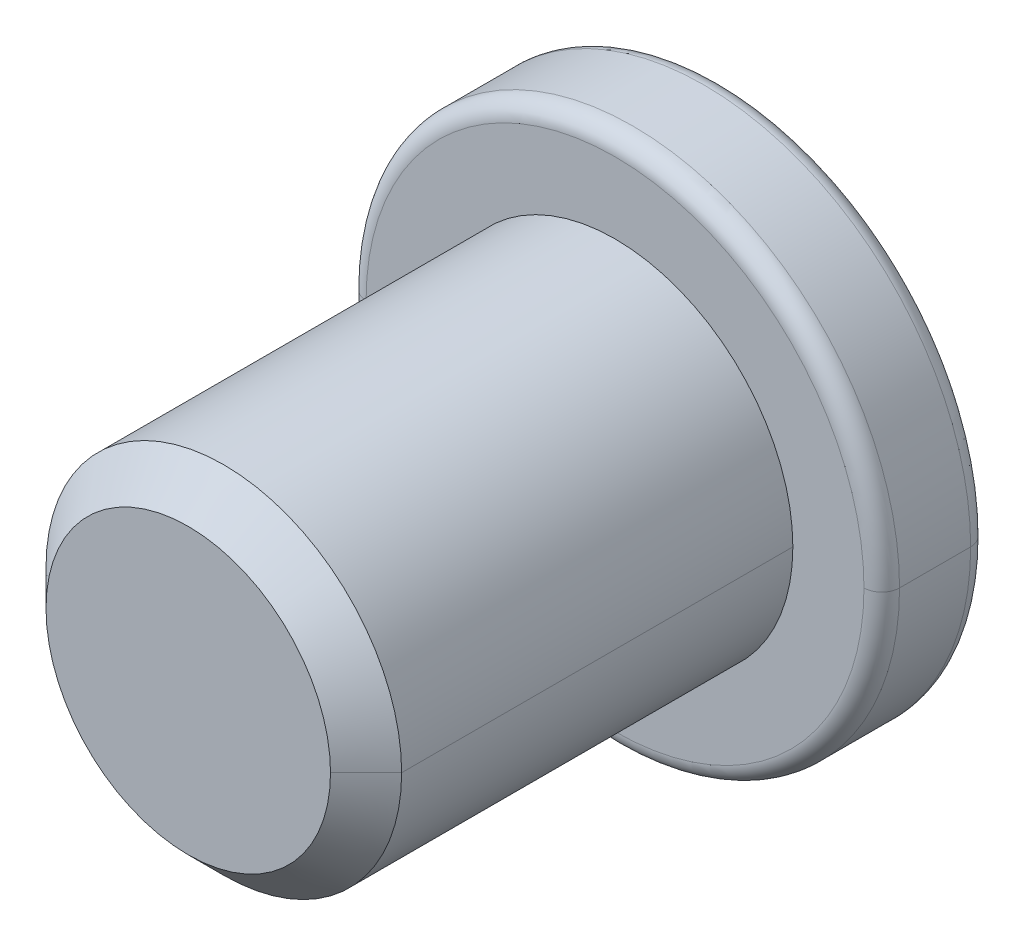
ISO-10303-21;
HEADER;
FILE_DESCRIPTION(('STEP AP214'),'2;1');
FILE_NAME('part.step','',(''),(''),'','','');
FILE_SCHEMA(('AUTOMOTIVE_DESIGN { 1 0 10303 214 1 1 1 1 }'));
ENDSEC;
DATA;
#1=APPLICATION_CONTEXT('core data for automotive mechanical design processes');
#2=APPLICATION_PROTOCOL_DEFINITION('international standard','automotive_design',2000,#1);
#3=PRODUCT_CONTEXT('',#1,'mechanical');
#4=PRODUCT('Part','Part','',(#3));
#5=PRODUCT_RELATED_PRODUCT_CATEGORY('part','',(#4));
#6=PRODUCT_DEFINITION_FORMATION('','',#4);
#7=PRODUCT_DEFINITION_CONTEXT('part definition',#1,'design');
#8=PRODUCT_DEFINITION('design','',#6,#7);
#9=PRODUCT_DEFINITION_SHAPE('','',#8);
#10=(LENGTH_UNIT() NAMED_UNIT(*) SI_UNIT(.MILLI.,.METRE.));
#11=(NAMED_UNIT(*) PLANE_ANGLE_UNIT() SI_UNIT($,.RADIAN.));
#12=(NAMED_UNIT(*) SI_UNIT($,.STERADIAN.) SOLID_ANGLE_UNIT());
#13=UNCERTAINTY_MEASURE_WITH_UNIT(LENGTH_MEASURE(1.E-05),#10,'distance_accuracy_value','');
#14=(GEOMETRIC_REPRESENTATION_CONTEXT(3) GLOBAL_UNCERTAINTY_ASSIGNED_CONTEXT((#13)) GLOBAL_UNIT_ASSIGNED_CONTEXT((#10,
#11,#12)) REPRESENTATION_CONTEXT('',''));
#15=CARTESIAN_POINT('',(0.,0.,0.));
#16=DIRECTION('',(0.,0.,1.));
#17=DIRECTION('',(1.,0.,0.));
#18=AXIS2_PLACEMENT_3D('',#15,#16,#17);
#19=CARTESIAN_POINT('',(0.,0.,-2.9));
#20=DIRECTION('',(0.,0.,-1.));
#21=DIRECTION('',(-1.,0.,0.));
#22=AXIS2_PLACEMENT_3D('',#19,#20,#21);
#23=TOROIDAL_SURFACE('',#22,1.4,0.1);
#24=CARTESIAN_POINT('',(1.39999999999998,0.,-2.9));
#25=DIRECTION('',(0.,1.,0.));
#26=DIRECTION('',(-1.,0.,0.));
#27=AXIS2_PLACEMENT_3D('',#24,#25,#26);
#28=CIRCLE('',#27,0.1);
#29=CARTESIAN_POINT('',(1.49999999999998,0.,-2.9));
#30=VERTEX_POINT('',#29);
#31=CARTESIAN_POINT('',(1.39999999999997,0.,-3.));
#32=VERTEX_POINT('',#31);
#33=EDGE_CURVE('E304',#30,#32,#28,.T.);
#34=ORIENTED_EDGE('',*,*,#33,.F.);
#35=CARTESIAN_POINT('',(0.,0.,-2.9));
#36=DIRECTION('',(0.,0.,1.));
#37=DIRECTION('',(-1.,0.,0.));
#38=AXIS2_PLACEMENT_3D('',#35,#36,#37);
#39=CIRCLE('',#38,1.5);
#40=CARTESIAN_POINT('',(-1.5,0.,-2.9));
#41=VERTEX_POINT('',#40);
#42=EDGE_CURVE('E279',#41,#30,#39,.T.);
#43=ORIENTED_EDGE('',*,*,#42,.F.);
#44=CARTESIAN_POINT('',(-1.40000000000002,0.,-2.9));
#45=DIRECTION('',(0.,-1.,0.));
#46=DIRECTION('',(1.,0.,0.));
#47=AXIS2_PLACEMENT_3D('',#44,#45,#46);
#48=CIRCLE('',#47,0.1);
#49=CARTESIAN_POINT('',(-1.40000000000003,0.,-3.));
#50=VERTEX_POINT('',#49);
#51=EDGE_CURVE('E303',#41,#50,#48,.T.);
#52=ORIENTED_EDGE('',*,*,#51,.T.);
#53=CARTESIAN_POINT('',(0.,0.,-3.));
#54=DIRECTION('',(0.,0.,-1.));
#55=DIRECTION('',(-1.,0.,0.));
#56=AXIS2_PLACEMENT_3D('',#53,#54,#55);
#57=CIRCLE('',#56,1.4);
#58=EDGE_CURVE('E278',#32,#50,#57,.T.);
#59=ORIENTED_EDGE('',*,*,#58,.F.);
#60=EDGE_LOOP('',(#34,#43,#52,#59));
#61=FACE_BOUND('',#60,.T.);
#62=ADVANCED_FACE('F16',(#61),#23,.T.);
#63=CARTESIAN_POINT('',(0.,0.,-2.5));
#64=DIRECTION('',(0.,0.,1.));
#65=DIRECTION('',(1.,0.,0.));
#66=AXIS2_PLACEMENT_3D('',#63,#64,#65);
#67=TOROIDAL_SURFACE('',#66,1.4,0.1);
#68=CARTESIAN_POINT('',(-1.40000000000003,0.,-2.5));
#69=DIRECTION('',(0.,1.,0.));
#70=DIRECTION('',(-1.,0.,0.));
#71=AXIS2_PLACEMENT_3D('',#68,#69,#70);
#72=CIRCLE('',#71,0.1);
#73=CARTESIAN_POINT('',(-1.50000000000003,0.,-2.5));
#74=VERTEX_POINT('',#73);
#75=CARTESIAN_POINT('',(-1.40000000000002,0.,-2.4));
#76=VERTEX_POINT('',#75);
#77=EDGE_CURVE('E354',#74,#76,#72,.T.);
#78=ORIENTED_EDGE('',*,*,#77,.F.);
#79=CARTESIAN_POINT('',(0.,0.,-2.5));
#80=DIRECTION('',(0.,0.,-1.));
#81=DIRECTION('',(1.,0.,0.));
#82=AXIS2_PLACEMENT_3D('',#79,#80,#81);
#83=CIRCLE('',#82,1.5);
#84=CARTESIAN_POINT('',(1.49999999999996,0.,-2.5));
#85=VERTEX_POINT('',#84);
#86=EDGE_CURVE('E275',#85,#74,#83,.T.);
#87=ORIENTED_EDGE('',*,*,#86,.F.);
#88=CARTESIAN_POINT('',(1.39999999999996,0.,-2.5));
#89=DIRECTION('',(0.,-1.,0.));
#90=DIRECTION('',(1.,0.,0.));
#91=AXIS2_PLACEMENT_3D('',#88,#89,#90);
#92=CIRCLE('',#91,0.1);
#93=CARTESIAN_POINT('',(1.39999999999998,0.,-2.4));
#94=VERTEX_POINT('',#93);
#95=EDGE_CURVE('E337',#85,#94,#92,.T.);
#96=ORIENTED_EDGE('',*,*,#95,.T.);
#97=CARTESIAN_POINT('',(0.,0.,-2.4));
#98=DIRECTION('',(0.,0.,1.));
#99=DIRECTION('',(1.,0.,0.));
#100=AXIS2_PLACEMENT_3D('',#97,#98,#99);
#101=CIRCLE('',#100,1.4);
#102=EDGE_CURVE('E341',#76,#94,#101,.T.);
#103=ORIENTED_EDGE('',*,*,#102,.F.);
#104=EDGE_LOOP('',(#78,#87,#96,#103));
#105=FACE_BOUND('',#104,.T.);
#106=ADVANCED_FACE('F429',(#105),#67,.T.);
#107=CARTESIAN_POINT('',(-0.30000000000002,0.300000000000008,-2.7));
#108=DIRECTION('',(0.,0.,1.));
#109=DIRECTION('',(1.,0.,0.));
#110=AXIS2_PLACEMENT_3D('',#107,#108,#109);
#111=PLANE('',#110);
#112=DIRECTION('',(0.,1.,0.));
#113=VECTOR('',#112,1.);
#114=CARTESIAN_POINT('',(-0.300000000000009,1.,-2.7));
#115=LINE('',#114,#113);
#116=CARTESIAN_POINT('',(-0.30000000000002,0.300000000000008,-2.7));
#117=VERTEX_POINT('',#116);
#118=CARTESIAN_POINT('',(-0.300000000000009,1.,-2.7));
#119=VERTEX_POINT('',#118);
#120=EDGE_CURVE('E357',#117,#119,#115,.T.);
#121=ORIENTED_EDGE('',*,*,#120,.T.);
#122=DIRECTION('',(1.,0.,0.));
#123=VECTOR('',#122,1.);
#124=CARTESIAN_POINT('',(-0.300000000000009,1.,-2.7));
#125=LINE('',#124,#123);
#126=CARTESIAN_POINT('',(0.299999999999991,1.,-2.7));
#127=VERTEX_POINT('',#126);
#128=EDGE_CURVE('E11',#119,#127,#125,.T.);
#129=ORIENTED_EDGE('',*,*,#128,.T.);
#130=DIRECTION('',(0.,-1.,0.));
#131=VECTOR('',#130,1.);
#132=CARTESIAN_POINT('',(0.299999999999991,1.,-2.7));
#133=LINE('',#132,#131);
#134=CARTESIAN_POINT('',(0.299999999999977,0.300000000000008,-2.7));
#135=VERTEX_POINT('',#134);
#136=EDGE_CURVE('E243',#127,#135,#133,.T.);
#137=ORIENTED_EDGE('',*,*,#136,.T.);
#138=DIRECTION('',(1.,0.,0.));
#139=VECTOR('',#138,1.);
#140=CARTESIAN_POINT('',(0.299999999999977,0.300000000000008,-2.7));
#141=LINE('',#140,#139);
#142=CARTESIAN_POINT('',(0.99999999999998,0.300000000000005,-2.7));
#143=VERTEX_POINT('',#142);
#144=EDGE_CURVE('E298',#135,#143,#141,.T.);
#145=ORIENTED_EDGE('',*,*,#144,.T.);
#146=DIRECTION('',(0.,-1.,0.));
#147=VECTOR('',#146,1.);
#148=CARTESIAN_POINT('',(0.99999999999998,0.300000000000005,-2.7));
#149=LINE('',#148,#147);
#150=CARTESIAN_POINT('',(0.999999999999973,-0.299999999999988,-2.7));
#151=VERTEX_POINT('',#150);
#152=EDGE_CURVE('E255',#143,#151,#149,.T.);
#153=ORIENTED_EDGE('',*,*,#152,.T.);
#154=DIRECTION('',(-1.,0.,0.));
#155=VECTOR('',#154,1.);
#156=CARTESIAN_POINT('',(0.299999999999984,-0.3,-2.7));
#157=LINE('',#156,#155);
#158=CARTESIAN_POINT('',(0.299999999999984,-0.3,-2.7));
#159=VERTEX_POINT('',#158);
#160=EDGE_CURVE('E256',#151,#159,#157,.T.);
#161=ORIENTED_EDGE('',*,*,#160,.T.);
#162=DIRECTION('',(0.,-1.,0.));
#163=VECTOR('',#162,1.);
#164=CARTESIAN_POINT('',(0.299999999999984,-0.3,-2.7));
#165=LINE('',#164,#163);
#166=CARTESIAN_POINT('',(0.299999999999982,-1.,-2.7));
#167=VERTEX_POINT('',#166);
#168=EDGE_CURVE('E232',#159,#167,#165,.T.);
#169=ORIENTED_EDGE('',*,*,#168,.T.);
#170=DIRECTION('',(-1.,0.,0.));
#171=VECTOR('',#170,1.);
#172=CARTESIAN_POINT('',(-0.300000000000008,-1.,-2.7));
#173=LINE('',#172,#171);
#174=CARTESIAN_POINT('',(-0.300000000000008,-1.,-2.7));
#175=VERTEX_POINT('',#174);
#176=EDGE_CURVE('E272',#167,#175,#173,.T.);
#177=ORIENTED_EDGE('',*,*,#176,.T.);
#178=DIRECTION('',(0.,1.,0.));
#179=VECTOR('',#178,1.);
#180=CARTESIAN_POINT('',(-0.300000000000031,-0.299999999999994,-2.7));
#181=LINE('',#180,#179);
#182=CARTESIAN_POINT('',(-0.300000000000031,-0.299999999999994,-2.7));
#183=VERTEX_POINT('',#182);
#184=EDGE_CURVE('E201',#175,#183,#181,.T.);
#185=ORIENTED_EDGE('',*,*,#184,.T.);
#186=DIRECTION('',(-1.,0.,0.));
#187=VECTOR('',#186,1.);
#188=CARTESIAN_POINT('',(-1.00000000000002,-0.299999999999994,-2.7));
#189=LINE('',#188,#187);
#190=CARTESIAN_POINT('',(-1.00000000000002,-0.299999999999994,-2.7));
#191=VERTEX_POINT('',#190);
#192=EDGE_CURVE('E194',#183,#191,#189,.T.);
#193=ORIENTED_EDGE('',*,*,#192,.T.);
#194=DIRECTION('',(0.,1.,0.));
#195=VECTOR('',#194,1.);
#196=CARTESIAN_POINT('',(-1.,0.3,-2.7));
#197=LINE('',#196,#195);
#198=CARTESIAN_POINT('',(-1.,0.3,-2.7));
#199=VERTEX_POINT('',#198);
#200=EDGE_CURVE('E198',#191,#199,#197,.T.);
#201=ORIENTED_EDGE('',*,*,#200,.T.);
#202=DIRECTION('',(1.,0.,0.));
#203=VECTOR('',#202,1.);
#204=CARTESIAN_POINT('',(-1.,0.3,-2.7));
#205=LINE('',#204,#203);
#206=EDGE_CURVE('E228',#199,#117,#205,.T.);
#207=ORIENTED_EDGE('',*,*,#206,.T.);
#208=EDGE_LOOP('',(#121,#129,#137,#145,#153,#161,#169,#177,#185,#193,#201,#207));
#209=FACE_BOUND('',#208,.T.);
#210=ADVANCED_FACE('F196',(#209),#111,.F.);
#211=CARTESIAN_POINT('',(-0.300000000000009,1.,-2.7));
#212=DIRECTION('',(0.,1.,0.));
#213=DIRECTION('',(1.,0.,0.));
#214=AXIS2_PLACEMENT_3D('',#211,#212,#213);
#215=PLANE('',#214);
#216=DIRECTION('',(1.,0.,0.));
#217=VECTOR('',#216,1.);
#218=CARTESIAN_POINT('',(-0.300000000000013,1.,-3.));
#219=LINE('',#218,#217);
#220=CARTESIAN_POINT('',(-0.300000000000013,1.,-3.));
#221=VERTEX_POINT('',#220);
#222=CARTESIAN_POINT('',(0.299999999999974,1.,-3.));
#223=VERTEX_POINT('',#222);
#224=EDGE_CURVE('E294',#221,#223,#219,.T.);
#225=ORIENTED_EDGE('',*,*,#224,.T.);
#226=DIRECTION('',(0.,0.,-1.));
#227=VECTOR('',#226,1.);
#228=CARTESIAN_POINT('',(0.299999999999991,1.,-2.7));
#229=LINE('',#228,#227);
#230=EDGE_CURVE('E27',#127,#223,#229,.T.);
#231=ORIENTED_EDGE('',*,*,#230,.F.);
#232=ORIENTED_EDGE('',*,*,#128,.F.);
#233=DIRECTION('',(0.,0.,-1.));
#234=VECTOR('',#233,1.);
#235=CARTESIAN_POINT('',(-0.300000000000009,1.,-2.7));
#236=LINE('',#235,#234);
#237=EDGE_CURVE('E385',#119,#221,#236,.T.);
#238=ORIENTED_EDGE('',*,*,#237,.T.);
#239=EDGE_LOOP('',(#225,#231,#232,#238));
#240=FACE_BOUND('',#239,.T.);
#241=ADVANCED_FACE('F506',(#240),#215,.F.);
#242=CARTESIAN_POINT('',(0.299999999999991,1.,-2.7));
#243=DIRECTION('',(1.,0.,0.));
#244=DIRECTION('',(0.,-1.,0.));
#245=AXIS2_PLACEMENT_3D('',#242,#243,#244);
#246=PLANE('',#245);
#247=DIRECTION('',(0.,-1.,0.));
#248=VECTOR('',#247,1.);
#249=CARTESIAN_POINT('',(0.299999999999974,1.,-3.));
#250=LINE('',#249,#248);
#251=CARTESIAN_POINT('',(0.299999999999981,0.299999999999994,-3.));
#252=VERTEX_POINT('',#251);
#253=EDGE_CURVE('E290',#223,#252,#250,.T.);
#254=ORIENTED_EDGE('',*,*,#253,.T.);
#255=DIRECTION('',(0.,0.,-1.));
#256=VECTOR('',#255,1.);
#257=CARTESIAN_POINT('',(0.299999999999977,0.300000000000008,-2.7));
#258=LINE('',#257,#256);
#259=EDGE_CURVE('E246',#135,#252,#258,.T.);
#260=ORIENTED_EDGE('',*,*,#259,.F.);
#261=ORIENTED_EDGE('',*,*,#136,.F.);
#262=ORIENTED_EDGE('',*,*,#230,.T.);
#263=EDGE_LOOP('',(#254,#260,#261,#262));
#264=FACE_BOUND('',#263,.T.);
#265=ADVANCED_FACE('F505',(#264),#246,.F.);
#266=CARTESIAN_POINT('',(0.299999999999977,0.300000000000008,-2.7));
#267=DIRECTION('',(0.,1.,0.));
#268=DIRECTION('',(1.,0.,0.));
#269=AXIS2_PLACEMENT_3D('',#266,#267,#268);
#270=PLANE('',#269);
#271=DIRECTION('',(1.,0.,0.));
#272=VECTOR('',#271,1.);
#273=CARTESIAN_POINT('',(0.299999999999981,0.299999999999994,-3.));
#274=LINE('',#273,#272);
#275=CARTESIAN_POINT('',(0.999999999999976,0.300000000000005,-3.));
#276=VERTEX_POINT('',#275);
#277=EDGE_CURVE('E241',#252,#276,#274,.T.);
#278=ORIENTED_EDGE('',*,*,#277,.T.);
#279=DIRECTION('',(0.,0.,-1.));
#280=VECTOR('',#279,1.);
#281=CARTESIAN_POINT('',(0.99999999999998,0.300000000000005,-2.7));
#282=LINE('',#281,#280);
#283=EDGE_CURVE('E295',#143,#276,#282,.T.);
#284=ORIENTED_EDGE('',*,*,#283,.F.);
#285=ORIENTED_EDGE('',*,*,#144,.F.);
#286=ORIENTED_EDGE('',*,*,#259,.T.);
#287=EDGE_LOOP('',(#278,#284,#285,#286));
#288=FACE_BOUND('',#287,.T.);
#289=ADVANCED_FACE('F501',(#288),#270,.F.);
#290=CARTESIAN_POINT('',(0.99999999999998,0.300000000000005,-2.7));
#291=DIRECTION('',(1.,0.,0.));
#292=DIRECTION('',(0.,-1.,0.));
#293=AXIS2_PLACEMENT_3D('',#290,#291,#292);
#294=PLANE('',#293);
#295=DIRECTION('',(0.,-1.,0.));
#296=VECTOR('',#295,1.);
#297=CARTESIAN_POINT('',(0.999999999999976,0.300000000000005,-3.));
#298=LINE('',#297,#296);
#299=CARTESIAN_POINT('',(0.999999999999973,-0.3,-3.));
#300=VERTEX_POINT('',#299);
#301=EDGE_CURVE('E237',#276,#300,#298,.T.);
#302=ORIENTED_EDGE('',*,*,#301,.T.);
#303=DIRECTION('',(0.,0.,-1.));
#304=VECTOR('',#303,1.);
#305=CARTESIAN_POINT('',(0.999999999999973,-0.299999999999988,-2.7));
#306=LINE('',#305,#304);
#307=EDGE_CURVE('E253',#151,#300,#306,.T.);
#308=ORIENTED_EDGE('',*,*,#307,.F.);
#309=ORIENTED_EDGE('',*,*,#152,.F.);
#310=ORIENTED_EDGE('',*,*,#283,.T.);
#311=EDGE_LOOP('',(#302,#308,#309,#310));
#312=FACE_BOUND('',#311,.T.);
#313=ADVANCED_FACE('F498',(#312),#294,.F.);
#314=CARTESIAN_POINT('',(0.299999999999984,-0.3,-2.7));
#315=DIRECTION('',(0.,-1.,0.));
#316=DIRECTION('',(0.,0.,-1.));
#317=AXIS2_PLACEMENT_3D('',#314,#315,#316);
#318=PLANE('',#317);
#319=DIRECTION('',(-1.,0.,0.));
#320=VECTOR('',#319,1.);
#321=CARTESIAN_POINT('',(0.299999999999974,-0.3,-3.));
#322=LINE('',#321,#320);
#323=CARTESIAN_POINT('',(0.299999999999974,-0.3,-3.));
#324=VERTEX_POINT('',#323);
#325=EDGE_CURVE('E242',#300,#324,#322,.T.);
#326=ORIENTED_EDGE('',*,*,#325,.T.);
#327=DIRECTION('',(0.,0.,-1.));
#328=VECTOR('',#327,1.);
#329=CARTESIAN_POINT('',(0.299999999999984,-0.3,-2.7));
#330=LINE('',#329,#328);
#331=EDGE_CURVE('E235',#159,#324,#330,.T.);
#332=ORIENTED_EDGE('',*,*,#331,.F.);
#333=ORIENTED_EDGE('',*,*,#160,.F.);
#334=ORIENTED_EDGE('',*,*,#307,.T.);
#335=EDGE_LOOP('',(#326,#332,#333,#334));
#336=FACE_BOUND('',#335,.T.);
#337=ADVANCED_FACE('F18',(#336),#318,.F.);
#338=CARTESIAN_POINT('',(0.299999999999984,-0.3,-2.7));
#339=DIRECTION('',(1.,0.,0.));
#340=DIRECTION('',(0.,-1.,0.));
#341=AXIS2_PLACEMENT_3D('',#338,#339,#340);
#342=PLANE('',#341);
#343=DIRECTION('',(0.,-1.,0.));
#344=VECTOR('',#343,1.);
#345=CARTESIAN_POINT('',(0.299999999999974,-0.3,-3.));
#346=LINE('',#345,#344);
#347=CARTESIAN_POINT('',(0.299999999999982,-1.,-3.));
#348=VERTEX_POINT('',#347);
#349=EDGE_CURVE('E283',#324,#348,#346,.T.);
#350=ORIENTED_EDGE('',*,*,#349,.T.);
#351=DIRECTION('',(0.,0.,-1.));
#352=VECTOR('',#351,1.);
#353=CARTESIAN_POINT('',(0.299999999999982,-1.,-2.7));
#354=LINE('',#353,#352);
#355=EDGE_CURVE('E236',#167,#348,#354,.T.);
#356=ORIENTED_EDGE('',*,*,#355,.F.);
#357=ORIENTED_EDGE('',*,*,#168,.F.);
#358=ORIENTED_EDGE('',*,*,#331,.T.);
#359=EDGE_LOOP('',(#350,#356,#357,#358));
#360=FACE_BOUND('',#359,.T.);
#361=ADVANCED_FACE('F476',(#360),#342,.F.);
#362=CARTESIAN_POINT('',(-0.300000000000008,-1.,-2.7));
#363=DIRECTION('',(0.,-1.,0.));
#364=DIRECTION('',(0.,0.,-1.));
#365=AXIS2_PLACEMENT_3D('',#362,#363,#364);
#366=PLANE('',#365);
#367=DIRECTION('',(-1.,0.,0.));
#368=VECTOR('',#367,1.);
#369=CARTESIAN_POINT('',(-0.3,-1.00000000000001,-3.));
#370=LINE('',#369,#368);
#371=CARTESIAN_POINT('',(-0.3,-1.00000000000001,-3.));
#372=VERTEX_POINT('',#371);
#373=EDGE_CURVE('E287',#348,#372,#370,.T.);
#374=ORIENTED_EDGE('',*,*,#373,.T.);
#375=DIRECTION('',(0.,0.,-1.));
#376=VECTOR('',#375,1.);
#377=CARTESIAN_POINT('',(-0.300000000000008,-1.,-2.7));
#378=LINE('',#377,#376);
#379=EDGE_CURVE('E260',#175,#372,#378,.T.);
#380=ORIENTED_EDGE('',*,*,#379,.F.);
#381=ORIENTED_EDGE('',*,*,#176,.F.);
#382=ORIENTED_EDGE('',*,*,#355,.T.);
#383=EDGE_LOOP('',(#374,#380,#381,#382));
#384=FACE_BOUND('',#383,.T.);
#385=ADVANCED_FACE('F492',(#384),#366,.F.);
#386=CARTESIAN_POINT('',(-0.300000000000031,-0.299999999999994,-2.7));
#387=DIRECTION('',(-1.,0.,0.));
#388=DIRECTION('',(0.,1.,0.));
#389=AXIS2_PLACEMENT_3D('',#386,#387,#388);
#390=PLANE('',#389);
#391=DIRECTION('',(0.,1.,0.));
#392=VECTOR('',#391,1.);
#393=CARTESIAN_POINT('',(-0.300000000000031,-0.3,-3.));
#394=LINE('',#393,#392);
#395=CARTESIAN_POINT('',(-0.300000000000031,-0.3,-3.));
#396=VERTEX_POINT('',#395);
#397=EDGE_CURVE('E271',#372,#396,#394,.T.);
#398=ORIENTED_EDGE('',*,*,#397,.T.);
#399=DIRECTION('',(0.,0.,-1.));
#400=VECTOR('',#399,1.);
#401=CARTESIAN_POINT('',(-0.300000000000031,-0.299999999999994,-2.7));
#402=LINE('',#401,#400);
#403=EDGE_CURVE('E206',#183,#396,#402,.T.);
#404=ORIENTED_EDGE('',*,*,#403,.F.);
#405=ORIENTED_EDGE('',*,*,#184,.F.);
#406=ORIENTED_EDGE('',*,*,#379,.T.);
#407=EDGE_LOOP('',(#398,#404,#405,#406));
#408=FACE_BOUND('',#407,.T.);
#409=ADVANCED_FACE('F524',(#408),#390,.F.);
#410=CARTESIAN_POINT('',(-1.00000000000002,-0.299999999999994,-2.7));
#411=DIRECTION('',(0.,-1.,0.));
#412=DIRECTION('',(-1.,0.,0.));
#413=AXIS2_PLACEMENT_3D('',#410,#411,#412);
#414=PLANE('',#413);
#415=DIRECTION('',(-1.,0.,0.));
#416=VECTOR('',#415,1.);
#417=CARTESIAN_POINT('',(-1.00000000000003,-0.300000000000008,-3.));
#418=LINE('',#417,#416);
#419=CARTESIAN_POINT('',(-1.00000000000003,-0.300000000000008,-3.));
#420=VERTEX_POINT('',#419);
#421=EDGE_CURVE('E212',#396,#420,#418,.T.);
#422=ORIENTED_EDGE('',*,*,#421,.T.);
#423=DIRECTION('',(0.,0.,-1.));
#424=VECTOR('',#423,1.);
#425=CARTESIAN_POINT('',(-1.00000000000002,-0.299999999999994,-2.7));
#426=LINE('',#425,#424);
#427=EDGE_CURVE('E207',#191,#420,#426,.T.);
#428=ORIENTED_EDGE('',*,*,#427,.F.);
#429=ORIENTED_EDGE('',*,*,#192,.F.);
#430=ORIENTED_EDGE('',*,*,#403,.T.);
#431=EDGE_LOOP('',(#422,#428,#429,#430));
#432=FACE_BOUND('',#431,.T.);
#433=ADVANCED_FACE('F210',(#432),#414,.F.);
#434=CARTESIAN_POINT('',(-1.,0.3,-2.7));
#435=DIRECTION('',(-1.,0.,0.));
#436=DIRECTION('',(0.,1.,0.));
#437=AXIS2_PLACEMENT_3D('',#434,#435,#436);
#438=PLANE('',#437);
#439=DIRECTION('',(0.,1.,0.));
#440=VECTOR('',#439,1.);
#441=CARTESIAN_POINT('',(-1.00000000000002,0.300000000000005,-3.));
#442=LINE('',#441,#440);
#443=CARTESIAN_POINT('',(-1.00000000000002,0.300000000000005,-3.));
#444=VERTEX_POINT('',#443);
#445=EDGE_CURVE('E265',#420,#444,#442,.T.);
#446=ORIENTED_EDGE('',*,*,#445,.T.);
#447=DIRECTION('',(0.,0.,-1.));
#448=VECTOR('',#447,1.);
#449=CARTESIAN_POINT('',(-1.,0.3,-2.7));
#450=LINE('',#449,#448);
#451=EDGE_CURVE('E220',#199,#444,#450,.T.);
#452=ORIENTED_EDGE('',*,*,#451,.F.);
#453=ORIENTED_EDGE('',*,*,#200,.F.);
#454=ORIENTED_EDGE('',*,*,#427,.T.);
#455=EDGE_LOOP('',(#446,#452,#453,#454));
#456=FACE_BOUND('',#455,.T.);
#457=ADVANCED_FACE('F218',(#456),#438,.F.);
#458=CARTESIAN_POINT('',(-1.,0.3,-2.7));
#459=DIRECTION('',(0.,1.,0.));
#460=DIRECTION('',(1.,0.,0.));
#461=AXIS2_PLACEMENT_3D('',#458,#459,#460);
#462=PLANE('',#461);
#463=DIRECTION('',(1.,0.,0.));
#464=VECTOR('',#463,1.);
#465=CARTESIAN_POINT('',(-1.00000000000002,0.300000000000005,-3.));
#466=LINE('',#465,#464);
#467=CARTESIAN_POINT('',(-0.300000000000031,0.3,-3.));
#468=VERTEX_POINT('',#467);
#469=EDGE_CURVE('E268',#444,#468,#466,.T.);
#470=ORIENTED_EDGE('',*,*,#469,.T.);
#471=DIRECTION('',(0.,0.,-1.));
#472=VECTOR('',#471,1.);
#473=CARTESIAN_POINT('',(-0.30000000000002,0.300000000000008,-2.7));
#474=LINE('',#473,#472);
#475=EDGE_CURVE('E119',#117,#468,#474,.T.);
#476=ORIENTED_EDGE('',*,*,#475,.F.);
#477=ORIENTED_EDGE('',*,*,#206,.F.);
#478=ORIENTED_EDGE('',*,*,#451,.T.);
#479=EDGE_LOOP('',(#470,#476,#477,#478));
#480=FACE_BOUND('',#479,.T.);
#481=ADVANCED_FACE('F510',(#480),#462,.F.);
#482=CARTESIAN_POINT('',(-0.300000000000009,1.,-2.7));
#483=DIRECTION('',(-1.,0.,0.));
#484=DIRECTION('',(0.,0.,1.));
#485=AXIS2_PLACEMENT_3D('',#482,#483,#484);
#486=PLANE('',#485);
#487=DIRECTION('',(0.,1.,0.));
#488=VECTOR('',#487,1.);
#489=CARTESIAN_POINT('',(-0.300000000000013,1.,-3.));
#490=LINE('',#489,#488);
#491=EDGE_CURVE('E282',#468,#221,#490,.T.);
#492=ORIENTED_EDGE('',*,*,#491,.T.);
#493=ORIENTED_EDGE('',*,*,#237,.F.);
#494=ORIENTED_EDGE('',*,*,#120,.F.);
#495=ORIENTED_EDGE('',*,*,#475,.T.);
#496=EDGE_LOOP('',(#492,#493,#494,#495));
#497=FACE_BOUND('',#496,.T.);
#498=ADVANCED_FACE('F507',(#497),#486,.F.);
#499=CARTESIAN_POINT('',(0.,0.,0.));
#500=DIRECTION('',(0.,0.,-1.));
#501=DIRECTION('',(-1.,0.,0.));
#502=AXIS2_PLACEMENT_3D('',#499,#500,#501);
#503=CONICAL_SURFACE('',#502,0.8,0.785398163397448);
#504=DIRECTION('',(0.707106781186547,0.,-0.707106781186548));
#505=VECTOR('',#504,1.);
#506=CARTESIAN_POINT('',(0.8,0.,0.));
#507=LINE('',#506,#505);
#508=CARTESIAN_POINT('',(0.8,0.,0.));
#509=VERTEX_POINT('',#508);
#510=CARTESIAN_POINT('',(1.,0.,-0.200000000000006));
#511=VERTEX_POINT('',#510);
#512=EDGE_CURVE('E415',#509,#511,#507,.T.);
#513=ORIENTED_EDGE('',*,*,#512,.F.);
#514=CARTESIAN_POINT('',(0.,0.,0.));
#515=DIRECTION('',(0.,0.,1.));
#516=DIRECTION('',(1.,0.,0.));
#517=AXIS2_PLACEMENT_3D('',#514,#515,#516);
#518=CIRCLE('',#517,0.8);
#519=CARTESIAN_POINT('',(-0.8,0.,0.));
#520=VERTEX_POINT('',#519);
#521=EDGE_CURVE('E264',#520,#509,#518,.T.);
#522=ORIENTED_EDGE('',*,*,#521,.F.);
#523=DIRECTION('',(-0.707106781186547,0.,-0.707106781186548));
#524=VECTOR('',#523,1.);
#525=CARTESIAN_POINT('',(-0.8,0.,0.));
#526=LINE('',#525,#524);
#527=CARTESIAN_POINT('',(-1.,0.,-0.200000000000006));
#528=VERTEX_POINT('',#527);
#529=EDGE_CURVE('E323',#520,#528,#526,.T.);
#530=ORIENTED_EDGE('',*,*,#529,.T.);
#531=CARTESIAN_POINT('',(0.,0.,-0.200000000000006));
#532=DIRECTION('',(0.,0.,-1.));
#533=DIRECTION('',(1.,0.,0.));
#534=AXIS2_PLACEMENT_3D('',#531,#532,#533);
#535=CIRCLE('',#534,1.);
#536=EDGE_CURVE('E263',#511,#528,#535,.T.);
#537=ORIENTED_EDGE('',*,*,#536,.F.);
#538=EDGE_LOOP('',(#513,#522,#530,#537));
#539=FACE_BOUND('',#538,.T.);
#540=ADVANCED_FACE('F517',(#539),#503,.T.);
#541=CARTESIAN_POINT('',(0.,-1.5,-3.));
#542=DIRECTION('',(0.,0.,-1.));
#543=DIRECTION('',(-1.,0.,0.));
#544=AXIS2_PLACEMENT_3D('',#541,#542,#543);
#545=PLANE('',#544);
#546=ORIENTED_EDGE('',*,*,#491,.F.);
#547=ORIENTED_EDGE('',*,*,#469,.F.);
#548=ORIENTED_EDGE('',*,*,#445,.F.);
#549=ORIENTED_EDGE('',*,*,#421,.F.);
#550=ORIENTED_EDGE('',*,*,#397,.F.);
#551=ORIENTED_EDGE('',*,*,#373,.F.);
#552=ORIENTED_EDGE('',*,*,#349,.F.);
#553=ORIENTED_EDGE('',*,*,#325,.F.);
#554=ORIENTED_EDGE('',*,*,#301,.F.);
#555=ORIENTED_EDGE('',*,*,#277,.F.);
#556=ORIENTED_EDGE('',*,*,#253,.F.);
#557=ORIENTED_EDGE('',*,*,#224,.F.);
#558=EDGE_LOOP('',(#546,#547,#548,#549,#550,#551,#552,#553,#554,#555,#556,#557));
#559=FACE_BOUND('',#558,.T.);
#560=CARTESIAN_POINT('',(0.,0.,-3.));
#561=DIRECTION('',(0.,0.,-1.));
#562=DIRECTION('',(-1.,0.,0.));
#563=AXIS2_PLACEMENT_3D('',#560,#561,#562);
#564=CIRCLE('',#563,1.4);
#565=EDGE_CURVE('E299',#50,#32,#564,.T.);
#566=ORIENTED_EDGE('',*,*,#565,.T.);
#567=ORIENTED_EDGE('',*,*,#58,.T.);
#568=EDGE_LOOP('',(#566,#567));
#569=FACE_BOUND('',#568,.T.);
#570=ADVANCED_FACE('F447',(#559,#569),#545,.T.);
#571=CARTESIAN_POINT('',(0.,0.,0.));
#572=DIRECTION('',(0.,0.,1.));
#573=DIRECTION('',(1.,0.,0.));
#574=AXIS2_PLACEMENT_3D('',#571,#572,#573);
#575=CYLINDRICAL_SURFACE('',#574,1.5);
#576=DIRECTION('',(0.,0.,1.));
#577=VECTOR('',#576,1.);
#578=CARTESIAN_POINT('',(-1.5,0.,0.));
#579=LINE('',#578,#577);
#580=EDGE_CURVE('E312',#41,#74,#579,.T.);
#581=ORIENTED_EDGE('',*,*,#580,.F.);
#582=ORIENTED_EDGE('',*,*,#42,.T.);
#583=DIRECTION('',(0.,0.,1.));
#584=VECTOR('',#583,1.);
#585=CARTESIAN_POINT('',(1.5,0.,0.));
#586=LINE('',#585,#584);
#587=EDGE_CURVE('E309',#30,#85,#586,.T.);
#588=ORIENTED_EDGE('',*,*,#587,.T.);
#589=ORIENTED_EDGE('',*,*,#86,.T.);
#590=EDGE_LOOP('',(#581,#582,#588,#589));
#591=FACE_BOUND('',#590,.T.);
#592=ADVANCED_FACE('F437',(#591),#575,.T.);
#593=CARTESIAN_POINT('',(0.,-1.00000000000001,-2.4));
#594=DIRECTION('',(0.,0.,1.));
#595=DIRECTION('',(1.,0.,0.));
#596=AXIS2_PLACEMENT_3D('',#593,#594,#595);
#597=PLANE('',#596);
#598=CARTESIAN_POINT('',(0.,0.,-2.4));
#599=DIRECTION('',(0.,0.,1.));
#600=DIRECTION('',(1.,0.,0.));
#601=AXIS2_PLACEMENT_3D('',#598,#599,#600);
#602=CIRCLE('',#601,1.);
#603=CARTESIAN_POINT('',(0.999999999999979,0.,-2.4));
#604=VERTEX_POINT('',#603);
#605=CARTESIAN_POINT('',(-1.00000000000002,0.,-2.4));
#606=VERTEX_POINT('',#605);
#607=EDGE_CURVE('E252',#604,#606,#602,.T.);
#608=ORIENTED_EDGE('',*,*,#607,.F.);
#609=CARTESIAN_POINT('',(0.,0.,-2.4));
#610=DIRECTION('',(0.,0.,1.));
#611=DIRECTION('',(1.,0.,0.));
#612=AXIS2_PLACEMENT_3D('',#609,#610,#611);
#613=CIRCLE('',#612,1.);
#614=EDGE_CURVE('E130',#606,#604,#613,.T.);
#615=ORIENTED_EDGE('',*,*,#614,.F.);
#616=EDGE_LOOP('',(#608,#615));
#617=FACE_BOUND('',#616,.T.);
#618=CARTESIAN_POINT('',(0.,0.,-2.4));
#619=DIRECTION('',(0.,0.,1.));
#620=DIRECTION('',(1.,0.,0.));
#621=AXIS2_PLACEMENT_3D('',#618,#619,#620);
#622=CIRCLE('',#621,1.4);
#623=EDGE_CURVE('E358',#94,#76,#622,.T.);
#624=ORIENTED_EDGE('',*,*,#623,.T.);
#625=ORIENTED_EDGE('',*,*,#102,.T.);
#626=EDGE_LOOP('',(#624,#625));
#627=FACE_BOUND('',#626,.T.);
#628=ADVANCED_FACE('F434',(#617,#627),#597,.T.);
#629=CARTESIAN_POINT('',(0.,0.,0.));
#630=DIRECTION('',(0.,0.,1.));
#631=DIRECTION('',(1.,0.,0.));
#632=AXIS2_PLACEMENT_3D('',#629,#630,#631);
#633=CYLINDRICAL_SURFACE('',#632,1.);
#634=DIRECTION('',(0.,0.,1.));
#635=VECTOR('',#634,1.);
#636=CARTESIAN_POINT('',(-1.,0.,0.));
#637=LINE('',#636,#635);
#638=EDGE_CURVE('E247',#606,#528,#637,.T.);
#639=ORIENTED_EDGE('',*,*,#638,.F.);
#640=ORIENTED_EDGE('',*,*,#614,.T.);
#641=DIRECTION('',(0.,0.,1.));
#642=VECTOR('',#641,1.);
#643=CARTESIAN_POINT('',(1.,0.,0.));
#644=LINE('',#643,#642);
#645=EDGE_CURVE('E251',#604,#511,#644,.T.);
#646=ORIENTED_EDGE('',*,*,#645,.T.);
#647=ORIENTED_EDGE('',*,*,#536,.T.);
#648=EDGE_LOOP('',(#639,#640,#646,#647));
#649=FACE_BOUND('',#648,.T.);
#650=ADVANCED_FACE('F436',(#649),#633,.T.);
#651=CARTESIAN_POINT('',(0.,0.,0.));
#652=DIRECTION('',(0.,0.,1.));
#653=DIRECTION('',(1.,0.,0.));
#654=AXIS2_PLACEMENT_3D('',#651,#652,#653);
#655=PLANE('',#654);
#656=ORIENTED_EDGE('',*,*,#521,.T.);
#657=CARTESIAN_POINT('',(0.,0.,0.));
#658=DIRECTION('',(0.,0.,1.));
#659=DIRECTION('',(1.,0.,0.));
#660=AXIS2_PLACEMENT_3D('',#657,#658,#659);
#661=CIRCLE('',#660,0.8);
#662=EDGE_CURVE('E412',#509,#520,#661,.T.);
#663=ORIENTED_EDGE('',*,*,#662,.T.);
#664=EDGE_LOOP('',(#656,#663));
#665=FACE_BOUND('',#664,.T.);
#666=ADVANCED_FACE('F444',(#665),#655,.T.);
#667=CARTESIAN_POINT('',(0.,0.,0.));
#668=DIRECTION('',(0.,0.,1.));
#669=DIRECTION('',(1.,0.,0.));
#670=AXIS2_PLACEMENT_3D('',#667,#668,#669);
#671=CYLINDRICAL_SURFACE('',#670,1.);
#672=ORIENTED_EDGE('',*,*,#607,.T.);
#673=ORIENTED_EDGE('',*,*,#638,.T.);
#674=CARTESIAN_POINT('',(0.,0.,-0.200000000000006));
#675=DIRECTION('',(0.,0.,-1.));
#676=DIRECTION('',(1.,0.,0.));
#677=AXIS2_PLACEMENT_3D('',#674,#675,#676);
#678=CIRCLE('',#677,1.);
#679=EDGE_CURVE('E20',#528,#511,#678,.T.);
#680=ORIENTED_EDGE('',*,*,#679,.T.);
#681=ORIENTED_EDGE('',*,*,#645,.F.);
#682=EDGE_LOOP('',(#672,#673,#680,#681));
#683=FACE_BOUND('',#682,.T.);
#684=ADVANCED_FACE('F530',(#683),#671,.T.);
#685=CARTESIAN_POINT('',(0.,0.,0.));
#686=DIRECTION('',(0.,0.,1.));
#687=DIRECTION('',(1.,0.,0.));
#688=AXIS2_PLACEMENT_3D('',#685,#686,#687);
#689=CYLINDRICAL_SURFACE('',#688,1.5);
#690=CARTESIAN_POINT('',(0.,0.,-2.9));
#691=DIRECTION('',(0.,0.,1.));
#692=DIRECTION('',(-1.,0.,0.));
#693=AXIS2_PLACEMENT_3D('',#690,#691,#692);
#694=CIRCLE('',#693,1.5);
#695=EDGE_CURVE('E378',#30,#41,#694,.T.);
#696=ORIENTED_EDGE('',*,*,#695,.T.);
#697=ORIENTED_EDGE('',*,*,#580,.T.);
#698=CARTESIAN_POINT('',(0.,0.,-2.5));
#699=DIRECTION('',(0.,0.,-1.));
#700=DIRECTION('',(1.,0.,0.));
#701=AXIS2_PLACEMENT_3D('',#698,#699,#700);
#702=CIRCLE('',#701,1.5);
#703=EDGE_CURVE('E351',#74,#85,#702,.T.);
#704=ORIENTED_EDGE('',*,*,#703,.T.);
#705=ORIENTED_EDGE('',*,*,#587,.F.);
#706=EDGE_LOOP('',(#696,#697,#704,#705));
#707=FACE_BOUND('',#706,.T.);
#708=ADVANCED_FACE('F526',(#707),#689,.T.);
#709=CARTESIAN_POINT('',(0.,0.,0.));
#710=DIRECTION('',(0.,0.,-1.));
#711=DIRECTION('',(-1.,0.,0.));
#712=AXIS2_PLACEMENT_3D('',#709,#710,#711);
#713=CONICAL_SURFACE('',#712,0.8,0.785398163397448);
#714=ORIENTED_EDGE('',*,*,#662,.F.);
#715=ORIENTED_EDGE('',*,*,#512,.T.);
#716=ORIENTED_EDGE('',*,*,#679,.F.);
#717=ORIENTED_EDGE('',*,*,#529,.F.);
#718=EDGE_LOOP('',(#714,#715,#716,#717));
#719=FACE_BOUND('',#718,.T.);
#720=ADVANCED_FACE('F529',(#719),#713,.T.);
#721=CARTESIAN_POINT('',(0.,0.,-2.5));
#722=DIRECTION('',(0.,0.,1.));
#723=DIRECTION('',(1.,0.,0.));
#724=AXIS2_PLACEMENT_3D('',#721,#722,#723);
#725=TOROIDAL_SURFACE('',#724,1.4,0.1);
#726=ORIENTED_EDGE('',*,*,#703,.F.);
#727=ORIENTED_EDGE('',*,*,#77,.T.);
#728=ORIENTED_EDGE('',*,*,#623,.F.);
#729=ORIENTED_EDGE('',*,*,#95,.F.);
#730=EDGE_LOOP('',(#726,#727,#728,#729));
#731=FACE_BOUND('',#730,.T.);
#732=ADVANCED_FACE('F432',(#731),#725,.T.);
#733=CARTESIAN_POINT('',(0.,0.,-2.9));
#734=DIRECTION('',(0.,0.,-1.));
#735=DIRECTION('',(-1.,0.,0.));
#736=AXIS2_PLACEMENT_3D('',#733,#734,#735);
#737=TOROIDAL_SURFACE('',#736,1.4,0.1);
#738=ORIENTED_EDGE('',*,*,#695,.F.);
#739=ORIENTED_EDGE('',*,*,#33,.T.);
#740=ORIENTED_EDGE('',*,*,#565,.F.);
#741=ORIENTED_EDGE('',*,*,#51,.F.);
#742=EDGE_LOOP('',(#738,#739,#740,#741));
#743=FACE_BOUND('',#742,.T.);
#744=ADVANCED_FACE('F464',(#743),#737,.T.);
#745=CLOSED_SHELL('',(#62,#106,#210,#241,#265,#289,#313,#337,#361,#385,#409,#433,#457,#481,#498,
#540,#570,#592,#628,#650,#666,#684,#708,#720,#732,#744));
#746=MANIFOLD_SOLID_BREP('B1',#745);
#747=ADVANCED_BREP_SHAPE_REPRESENTATION('',(#18,#746),#14);
#748=SHAPE_DEFINITION_REPRESENTATION(#9,#747);
ENDSEC;
END-ISO-10303-21;
